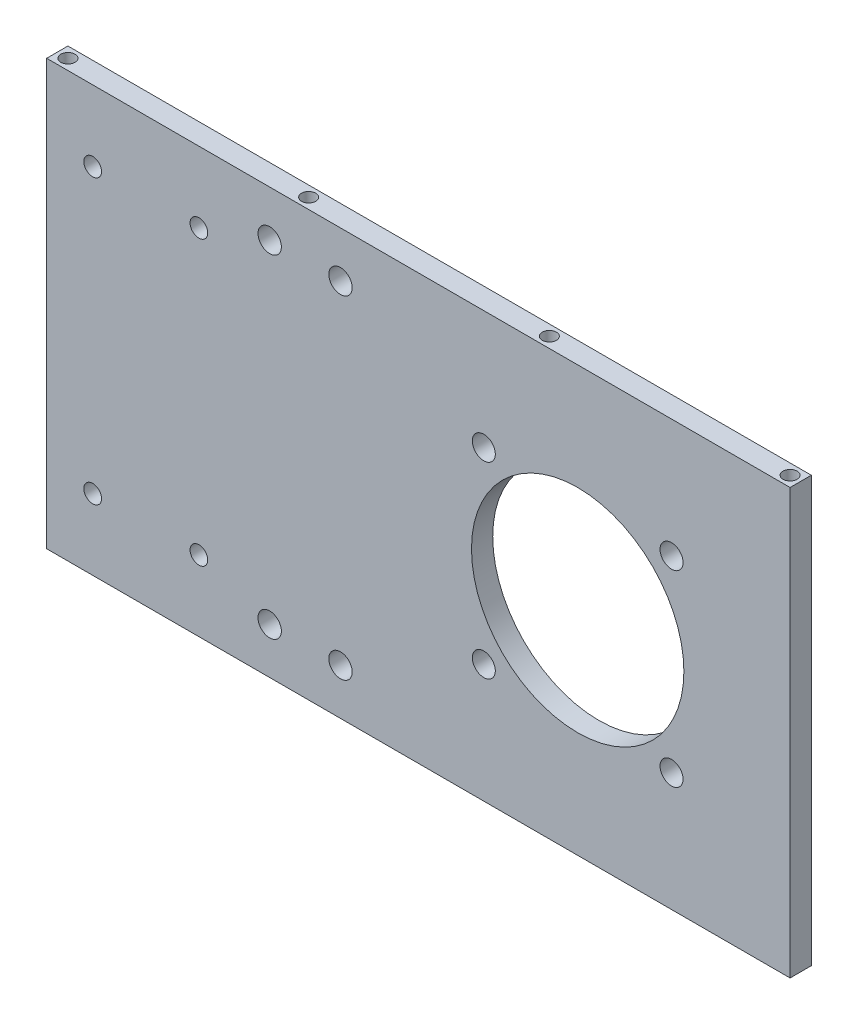
ISO-10303-21;
HEADER;
FILE_DESCRIPTION(('STEP AP214'),'2;1');
FILE_NAME('part.step','',(''),(''),'','','');
FILE_SCHEMA(('AUTOMOTIVE_DESIGN { 1 0 10303 214 1 1 1 1 }'));
ENDSEC;
DATA;
#1=APPLICATION_CONTEXT('core data for automotive mechanical design processes');
#2=APPLICATION_PROTOCOL_DEFINITION('international standard','automotive_design',2000,#1);
#3=PRODUCT_CONTEXT('',#1,'mechanical');
#4=PRODUCT('Part','Part','',(#3));
#5=PRODUCT_RELATED_PRODUCT_CATEGORY('part','',(#4));
#6=PRODUCT_DEFINITION_FORMATION('','',#4);
#7=PRODUCT_DEFINITION_CONTEXT('part definition',#1,'design');
#8=PRODUCT_DEFINITION('design','',#6,#7);
#9=PRODUCT_DEFINITION_SHAPE('','',#8);
#10=(LENGTH_UNIT() NAMED_UNIT(*) SI_UNIT(.MILLI.,.METRE.));
#11=(NAMED_UNIT(*) PLANE_ANGLE_UNIT() SI_UNIT($,.RADIAN.));
#12=(NAMED_UNIT(*) SI_UNIT($,.STERADIAN.) SOLID_ANGLE_UNIT());
#13=UNCERTAINTY_MEASURE_WITH_UNIT(LENGTH_MEASURE(1.E-05),#10,'distance_accuracy_value','');
#14=(GEOMETRIC_REPRESENTATION_CONTEXT(3) GLOBAL_UNCERTAINTY_ASSIGNED_CONTEXT((#13)) GLOBAL_UNIT_ASSIGNED_CONTEXT((#10,
#11,#12)) REPRESENTATION_CONTEXT('',''));
#15=CARTESIAN_POINT('',(0.,0.,0.));
#16=DIRECTION('',(0.,0.,1.));
#17=DIRECTION('',(1.,0.,0.));
#18=AXIS2_PLACEMENT_3D('',#15,#16,#17);
#19=CARTESIAN_POINT('',(60.,60.,6.));
#20=DIRECTION('',(0.,-1.,0.));
#21=DIRECTION('',(1.,0.,0.));
#22=AXIS2_PLACEMENT_3D('',#19,#20,#21);
#23=PLANE('',#22);
#24=CARTESIAN_POINT('',(-79.,60.,3.));
#25=DIRECTION('',(0.,-1.,0.));
#26=DIRECTION('',(1.,0.,0.));
#27=AXIS2_PLACEMENT_3D('',#24,#25,#26);
#28=CIRCLE('',#27,2.);
#29=CARTESIAN_POINT('',(-77.,60.,3.));
#30=VERTEX_POINT('',#29);
#31=EDGE_CURVE('E156',#30,#30,#28,.T.);
#32=ORIENTED_EDGE('',*,*,#31,.T.);
#33=EDGE_LOOP('',(#32));
#34=FACE_BOUND('',#33,.T.);
#35=CARTESIAN_POINT('',(57.,60.,3.));
#36=DIRECTION('',(0.,-1.,0.));
#37=DIRECTION('',(1.,0.,0.));
#38=AXIS2_PLACEMENT_3D('',#35,#36,#37);
#39=CIRCLE('',#38,2.);
#40=CARTESIAN_POINT('',(59.,60.,3.));
#41=VERTEX_POINT('',#40);
#42=EDGE_CURVE('E168',#41,#41,#39,.T.);
#43=ORIENTED_EDGE('',*,*,#42,.T.);
#44=EDGE_LOOP('',(#43));
#45=FACE_BOUND('',#44,.T.);
#46=DIRECTION('',(-1.,0.,0.));
#47=VECTOR('',#46,1.);
#48=CARTESIAN_POINT('',(60.,60.,0.));
#49=LINE('',#48,#47);
#50=CARTESIAN_POINT('',(60.,60.,0.));
#51=VERTEX_POINT('',#50);
#52=CARTESIAN_POINT('',(-150.,60.,0.));
#53=VERTEX_POINT('',#52);
#54=EDGE_CURVE('E70',#51,#53,#49,.T.);
#55=ORIENTED_EDGE('',*,*,#54,.T.);
#56=DIRECTION('',(0.,0.,-1.));
#57=VECTOR('',#56,1.);
#58=CARTESIAN_POINT('',(-150.,60.,6.));
#59=LINE('',#58,#57);
#60=CARTESIAN_POINT('',(-150.,60.,6.));
#61=VERTEX_POINT('',#60);
#62=EDGE_CURVE('E94',#61,#53,#59,.T.);
#63=ORIENTED_EDGE('',*,*,#62,.F.);
#64=DIRECTION('',(-1.,0.,0.));
#65=VECTOR('',#64,1.);
#66=CARTESIAN_POINT('',(60.,60.,6.));
#67=LINE('',#66,#65);
#68=CARTESIAN_POINT('',(60.,60.,6.));
#69=VERTEX_POINT('',#68);
#70=EDGE_CURVE('E87',#69,#61,#67,.T.);
#71=ORIENTED_EDGE('',*,*,#70,.F.);
#72=DIRECTION('',(0.,0.,-1.));
#73=VECTOR('',#72,1.);
#74=CARTESIAN_POINT('',(60.,60.,6.));
#75=LINE('',#74,#73);
#76=EDGE_CURVE('E44',#69,#51,#75,.T.);
#77=ORIENTED_EDGE('',*,*,#76,.T.);
#78=EDGE_LOOP('',(#55,#63,#71,#77));
#79=FACE_BOUND('',#78,.T.);
#80=CARTESIAN_POINT('',(-11.,60.,3.));
#81=DIRECTION('',(0.,-1.,0.));
#82=DIRECTION('',(1.,0.,0.));
#83=AXIS2_PLACEMENT_3D('',#80,#81,#82);
#84=CIRCLE('',#83,2.);
#85=CARTESIAN_POINT('',(-9.,60.,3.));
#86=VERTEX_POINT('',#85);
#87=EDGE_CURVE('E162',#86,#86,#84,.T.);
#88=ORIENTED_EDGE('',*,*,#87,.T.);
#89=EDGE_LOOP('',(#88));
#90=FACE_BOUND('',#89,.T.);
#91=CARTESIAN_POINT('',(-147.,60.,3.));
#92=DIRECTION('',(0.,-1.,0.));
#93=DIRECTION('',(1.,0.,0.));
#94=AXIS2_PLACEMENT_3D('',#91,#92,#93);
#95=CIRCLE('',#94,2.);
#96=CARTESIAN_POINT('',(-145.,60.,3.));
#97=VERTEX_POINT('',#96);
#98=EDGE_CURVE('E131',#97,#97,#95,.T.);
#99=ORIENTED_EDGE('',*,*,#98,.T.);
#100=EDGE_LOOP('',(#99));
#101=FACE_BOUND('',#100,.T.);
#102=ADVANCED_FACE('F34',(#34,#45,#79,#90,#101),#23,.F.);
#103=CARTESIAN_POINT('',(0.,0.,6.));
#104=DIRECTION('',(0.,0.,1.));
#105=DIRECTION('',(1.,0.,0.));
#106=AXIS2_PLACEMENT_3D('',#103,#104,#105);
#107=PLANE('',#106);
#108=CARTESIAN_POINT('',(-87.,-47.,6.));
#109=DIRECTION('',(0.,0.,1.));
#110=DIRECTION('',(-1.,0.,0.));
#111=AXIS2_PLACEMENT_3D('',#108,#109,#110);
#112=CIRCLE('',#111,3.3);
#113=CARTESIAN_POINT('',(-90.3,-47.,6.));
#114=VERTEX_POINT('',#113);
#115=EDGE_CURVE('E148',#114,#114,#112,.T.);
#116=ORIENTED_EDGE('',*,*,#115,.F.);
#117=EDGE_LOOP('',(#116));
#118=FACE_BOUND('',#117,.T.);
#119=CARTESIAN_POINT('',(-67.,-47.,6.));
#120=DIRECTION('',(0.,0.,1.));
#121=DIRECTION('',(1.,0.,0.));
#122=AXIS2_PLACEMENT_3D('',#119,#120,#121);
#123=CIRCLE('',#122,3.3);
#124=CARTESIAN_POINT('',(-63.7,-47.,6.));
#125=VERTEX_POINT('',#124);
#126=EDGE_CURVE('E138',#125,#125,#123,.T.);
#127=ORIENTED_EDGE('',*,*,#126,.F.);
#128=EDGE_LOOP('',(#127));
#129=FACE_BOUND('',#128,.T.);
#130=CARTESIAN_POINT('',(-67.,47.,6.));
#131=DIRECTION('',(0.,0.,1.));
#132=DIRECTION('',(-1.,0.,0.));
#133=AXIS2_PLACEMENT_3D('',#130,#131,#132);
#134=CIRCLE('',#133,3.3);
#135=CARTESIAN_POINT('',(-70.3,47.,6.));
#136=VERTEX_POINT('',#135);
#137=EDGE_CURVE('E135',#136,#136,#134,.T.);
#138=ORIENTED_EDGE('',*,*,#137,.F.);
#139=EDGE_LOOP('',(#138));
#140=FACE_BOUND('',#139,.T.);
#141=CARTESIAN_POINT('',(-87.,47.,6.));
#142=DIRECTION('',(0.,0.,1.));
#143=DIRECTION('',(1.,0.,0.));
#144=AXIS2_PLACEMENT_3D('',#141,#142,#143);
#145=CIRCLE('',#144,3.3);
#146=CARTESIAN_POINT('',(-83.7,47.,6.));
#147=VERTEX_POINT('',#146);
#148=EDGE_CURVE('E132',#147,#147,#145,.T.);
#149=ORIENTED_EDGE('',*,*,#148,.F.);
#150=EDGE_LOOP('',(#149));
#151=FACE_BOUND('',#150,.T.);
#152=CARTESIAN_POINT('',(-137.,-40.,6.));
#153=DIRECTION('',(0.,0.,1.));
#154=DIRECTION('',(1.,0.,0.));
#155=AXIS2_PLACEMENT_3D('',#152,#153,#154);
#156=CIRCLE('',#155,2.5);
#157=CARTESIAN_POINT('',(-134.5,-40.,6.));
#158=VERTEX_POINT('',#157);
#159=EDGE_CURVE('E127',#158,#158,#156,.T.);
#160=ORIENTED_EDGE('',*,*,#159,.F.);
#161=EDGE_LOOP('',(#160));
#162=FACE_BOUND('',#161,.T.);
#163=CARTESIAN_POINT('',(-107.,-40.,6.));
#164=DIRECTION('',(0.,0.,1.));
#165=DIRECTION('',(1.,0.,0.));
#166=AXIS2_PLACEMENT_3D('',#163,#164,#165);
#167=CIRCLE('',#166,2.50000000000001);
#168=CARTESIAN_POINT('',(-104.5,-40.,6.));
#169=VERTEX_POINT('',#168);
#170=EDGE_CURVE('E123',#169,#169,#167,.T.);
#171=ORIENTED_EDGE('',*,*,#170,.F.);
#172=EDGE_LOOP('',(#171));
#173=FACE_BOUND('',#172,.T.);
#174=CARTESIAN_POINT('',(-107.,40.,6.));
#175=DIRECTION('',(0.,0.,1.));
#176=DIRECTION('',(1.,0.,0.));
#177=AXIS2_PLACEMENT_3D('',#174,#175,#176);
#178=CIRCLE('',#177,2.5);
#179=CARTESIAN_POINT('',(-104.5,40.,6.));
#180=VERTEX_POINT('',#179);
#181=EDGE_CURVE('E119',#180,#180,#178,.T.);
#182=ORIENTED_EDGE('',*,*,#181,.F.);
#183=EDGE_LOOP('',(#182));
#184=FACE_BOUND('',#183,.T.);
#185=CARTESIAN_POINT('',(-137.,40.,6.));
#186=DIRECTION('',(0.,0.,1.));
#187=DIRECTION('',(1.,0.,0.));
#188=AXIS2_PLACEMENT_3D('',#185,#186,#187);
#189=CIRCLE('',#188,2.5);
#190=CARTESIAN_POINT('',(-134.5,40.,6.));
#191=VERTEX_POINT('',#190);
#192=EDGE_CURVE('E115',#191,#191,#189,.T.);
#193=ORIENTED_EDGE('',*,*,#192,.F.);
#194=EDGE_LOOP('',(#193));
#195=FACE_BOUND('',#194,.T.);
#196=CARTESIAN_POINT('',(-26.5165042944938,-26.5165042944972,6.));
#197=DIRECTION('',(0.,0.,1.));
#198=DIRECTION('',(1.,0.,0.));
#199=AXIS2_PLACEMENT_3D('',#196,#197,#198);
#200=CIRCLE('',#199,3.25);
#201=CARTESIAN_POINT('',(-23.2665042944938,-26.5165042944972,6.));
#202=VERTEX_POINT('',#201);
#203=EDGE_CURVE('E214',#202,#202,#200,.T.);
#204=ORIENTED_EDGE('',*,*,#203,.F.);
#205=EDGE_LOOP('',(#204));
#206=FACE_BOUND('',#205,.T.);
#207=CARTESIAN_POINT('',(0.,0.,6.));
#208=DIRECTION('',(0.,0.,1.));
#209=DIRECTION('',(1.,0.,0.));
#210=AXIS2_PLACEMENT_3D('',#207,#208,#209);
#211=CIRCLE('',#210,30.);
#212=CARTESIAN_POINT('',(30.,0.,6.));
#213=VERTEX_POINT('',#212);
#214=EDGE_CURVE('E226',#213,#213,#211,.T.);
#215=ORIENTED_EDGE('',*,*,#214,.F.);
#216=EDGE_LOOP('',(#215));
#217=FACE_BOUND('',#216,.T.);
#218=DIRECTION('',(1.,0.,0.));
#219=VECTOR('',#218,1.);
#220=CARTESIAN_POINT('',(60.,-60.,6.));
#221=LINE('',#220,#219);
#222=CARTESIAN_POINT('',(-150.,-60.,6.));
#223=VERTEX_POINT('',#222);
#224=CARTESIAN_POINT('',(60.,-60.,6.));
#225=VERTEX_POINT('',#224);
#226=EDGE_CURVE('E89',#223,#225,#221,.T.);
#227=ORIENTED_EDGE('',*,*,#226,.T.);
#228=DIRECTION('',(0.,1.,0.));
#229=VECTOR('',#228,1.);
#230=CARTESIAN_POINT('',(60.,-60.,6.));
#231=LINE('',#230,#229);
#232=EDGE_CURVE('E83',#225,#69,#231,.T.);
#233=ORIENTED_EDGE('',*,*,#232,.T.);
#234=ORIENTED_EDGE('',*,*,#70,.T.);
#235=DIRECTION('',(0.,-1.,0.));
#236=VECTOR('',#235,1.);
#237=CARTESIAN_POINT('',(-150.,60.,6.));
#238=LINE('',#237,#236);
#239=EDGE_CURVE('E53',#61,#223,#238,.T.);
#240=ORIENTED_EDGE('',*,*,#239,.T.);
#241=EDGE_LOOP('',(#227,#233,#234,#240));
#242=FACE_BOUND('',#241,.T.);
#243=CARTESIAN_POINT('',(26.5165042944955,26.5165042944956,6.));
#244=DIRECTION('',(0.,0.,1.));
#245=DIRECTION('',(1.,0.,0.));
#246=AXIS2_PLACEMENT_3D('',#243,#244,#245);
#247=CIRCLE('',#246,3.25);
#248=CARTESIAN_POINT('',(29.7665042944955,26.5165042944956,6.));
#249=VERTEX_POINT('',#248);
#250=EDGE_CURVE('E105',#249,#249,#247,.T.);
#251=ORIENTED_EDGE('',*,*,#250,.F.);
#252=EDGE_LOOP('',(#251));
#253=FACE_BOUND('',#252,.T.);
#254=CARTESIAN_POINT('',(26.5165042944972,-26.5165042944955,6.));
#255=DIRECTION('',(0.,0.,1.));
#256=DIRECTION('',(1.,0.,0.));
#257=AXIS2_PLACEMENT_3D('',#254,#255,#256);
#258=CIRCLE('',#257,3.25);
#259=CARTESIAN_POINT('',(29.7665042944972,-26.5165042944955,6.));
#260=VERTEX_POINT('',#259);
#261=EDGE_CURVE('E220',#260,#260,#258,.T.);
#262=ORIENTED_EDGE('',*,*,#261,.F.);
#263=EDGE_LOOP('',(#262));
#264=FACE_BOUND('',#263,.T.);
#265=CARTESIAN_POINT('',(-26.5165042944956,26.5165042944938,6.));
#266=DIRECTION('',(0.,0.,1.));
#267=DIRECTION('',(1.,0.,0.));
#268=AXIS2_PLACEMENT_3D('',#265,#266,#267);
#269=CIRCLE('',#268,3.25);
#270=CARTESIAN_POINT('',(-23.2665042944956,26.5165042944938,6.));
#271=VERTEX_POINT('',#270);
#272=EDGE_CURVE('E208',#271,#271,#269,.T.);
#273=ORIENTED_EDGE('',*,*,#272,.F.);
#274=EDGE_LOOP('',(#273));
#275=FACE_BOUND('',#274,.T.);
#276=ADVANCED_FACE('F84',(#118,#129,#140,#151,#162,#173,#184,#195,#206,#217,#242,#253,#264,
#275),#107,.T.);
#277=CARTESIAN_POINT('',(0.,0.,0.));
#278=DIRECTION('',(0.,0.,1.));
#279=DIRECTION('',(1.,0.,0.));
#280=AXIS2_PLACEMENT_3D('',#277,#278,#279);
#281=PLANE('',#280);
#282=CARTESIAN_POINT('',(-87.,-47.,0.));
#283=DIRECTION('',(0.,0.,1.));
#284=DIRECTION('',(1.,0.,0.));
#285=AXIS2_PLACEMENT_3D('',#282,#283,#284);
#286=CIRCLE('',#285,3.3);
#287=CARTESIAN_POINT('',(-83.7,-47.,0.));
#288=VERTEX_POINT('',#287);
#289=EDGE_CURVE('E38',#288,#288,#286,.T.);
#290=ORIENTED_EDGE('',*,*,#289,.T.);
#291=EDGE_LOOP('',(#290));
#292=FACE_BOUND('',#291,.T.);
#293=CARTESIAN_POINT('',(-67.,-47.,0.));
#294=DIRECTION('',(0.,0.,1.));
#295=DIRECTION('',(1.,0.,0.));
#296=AXIS2_PLACEMENT_3D('',#293,#294,#295);
#297=CIRCLE('',#296,3.3);
#298=CARTESIAN_POINT('',(-63.7,-47.,0.));
#299=VERTEX_POINT('',#298);
#300=EDGE_CURVE('E136',#299,#299,#297,.T.);
#301=ORIENTED_EDGE('',*,*,#300,.T.);
#302=EDGE_LOOP('',(#301));
#303=FACE_BOUND('',#302,.T.);
#304=CARTESIAN_POINT('',(-67.,47.,0.));
#305=DIRECTION('',(0.,0.,1.));
#306=DIRECTION('',(1.,0.,0.));
#307=AXIS2_PLACEMENT_3D('',#304,#305,#306);
#308=CIRCLE('',#307,3.3);
#309=CARTESIAN_POINT('',(-63.7,47.,0.));
#310=VERTEX_POINT('',#309);
#311=EDGE_CURVE('E133',#310,#310,#308,.T.);
#312=ORIENTED_EDGE('',*,*,#311,.T.);
#313=EDGE_LOOP('',(#312));
#314=FACE_BOUND('',#313,.T.);
#315=CARTESIAN_POINT('',(-87.,47.,0.));
#316=DIRECTION('',(0.,0.,1.));
#317=DIRECTION('',(1.,0.,0.));
#318=AXIS2_PLACEMENT_3D('',#315,#316,#317);
#319=CIRCLE('',#318,3.3);
#320=CARTESIAN_POINT('',(-83.7,47.,0.));
#321=VERTEX_POINT('',#320);
#322=EDGE_CURVE('E128',#321,#321,#319,.T.);
#323=ORIENTED_EDGE('',*,*,#322,.T.);
#324=EDGE_LOOP('',(#323));
#325=FACE_BOUND('',#324,.T.);
#326=CARTESIAN_POINT('',(-137.,-40.,0.));
#327=DIRECTION('',(0.,0.,1.));
#328=DIRECTION('',(1.,0.,0.));
#329=AXIS2_PLACEMENT_3D('',#326,#327,#328);
#330=CIRCLE('',#329,2.5);
#331=CARTESIAN_POINT('',(-134.5,-40.,0.));
#332=VERTEX_POINT('',#331);
#333=EDGE_CURVE('E124',#332,#332,#330,.T.);
#334=ORIENTED_EDGE('',*,*,#333,.T.);
#335=EDGE_LOOP('',(#334));
#336=FACE_BOUND('',#335,.T.);
#337=CARTESIAN_POINT('',(-107.,-40.,0.));
#338=DIRECTION('',(0.,0.,1.));
#339=DIRECTION('',(1.,0.,0.));
#340=AXIS2_PLACEMENT_3D('',#337,#338,#339);
#341=CIRCLE('',#340,2.50000000000001);
#342=CARTESIAN_POINT('',(-104.5,-40.,0.));
#343=VERTEX_POINT('',#342);
#344=EDGE_CURVE('E120',#343,#343,#341,.T.);
#345=ORIENTED_EDGE('',*,*,#344,.T.);
#346=EDGE_LOOP('',(#345));
#347=FACE_BOUND('',#346,.T.);
#348=CARTESIAN_POINT('',(-107.,40.,0.));
#349=DIRECTION('',(0.,0.,1.));
#350=DIRECTION('',(1.,0.,0.));
#351=AXIS2_PLACEMENT_3D('',#348,#349,#350);
#352=CIRCLE('',#351,2.5);
#353=CARTESIAN_POINT('',(-104.5,40.,0.));
#354=VERTEX_POINT('',#353);
#355=EDGE_CURVE('E116',#354,#354,#352,.T.);
#356=ORIENTED_EDGE('',*,*,#355,.T.);
#357=EDGE_LOOP('',(#356));
#358=FACE_BOUND('',#357,.T.);
#359=CARTESIAN_POINT('',(-137.,40.,0.));
#360=DIRECTION('',(0.,0.,1.));
#361=DIRECTION('',(1.,0.,0.));
#362=AXIS2_PLACEMENT_3D('',#359,#360,#361);
#363=CIRCLE('',#362,2.5);
#364=CARTESIAN_POINT('',(-134.5,40.,0.));
#365=VERTEX_POINT('',#364);
#366=EDGE_CURVE('E111',#365,#365,#363,.T.);
#367=ORIENTED_EDGE('',*,*,#366,.T.);
#368=EDGE_LOOP('',(#367));
#369=FACE_BOUND('',#368,.T.);
#370=CARTESIAN_POINT('',(-26.5165042944938,-26.5165042944972,0.));
#371=DIRECTION('',(0.,0.,1.));
#372=DIRECTION('',(1.,0.,0.));
#373=AXIS2_PLACEMENT_3D('',#370,#371,#372);
#374=CIRCLE('',#373,3.25);
#375=CARTESIAN_POINT('',(-23.2665042944938,-26.5165042944972,0.));
#376=VERTEX_POINT('',#375);
#377=EDGE_CURVE('E211',#376,#376,#374,.T.);
#378=ORIENTED_EDGE('',*,*,#377,.T.);
#379=EDGE_LOOP('',(#378));
#380=FACE_BOUND('',#379,.T.);
#381=CARTESIAN_POINT('',(0.,0.,0.));
#382=DIRECTION('',(0.,0.,1.));
#383=DIRECTION('',(1.,0.,0.));
#384=AXIS2_PLACEMENT_3D('',#381,#382,#383);
#385=CIRCLE('',#384,30.);
#386=CARTESIAN_POINT('',(30.,0.,0.));
#387=VERTEX_POINT('',#386);
#388=EDGE_CURVE('E223',#387,#387,#385,.T.);
#389=ORIENTED_EDGE('',*,*,#388,.T.);
#390=EDGE_LOOP('',(#389));
#391=FACE_BOUND('',#390,.T.);
#392=DIRECTION('',(1.,0.,0.));
#393=VECTOR('',#392,1.);
#394=CARTESIAN_POINT('',(60.,-60.,0.));
#395=LINE('',#394,#393);
#396=CARTESIAN_POINT('',(-150.,-60.,0.));
#397=VERTEX_POINT('',#396);
#398=CARTESIAN_POINT('',(60.,-60.,0.));
#399=VERTEX_POINT('',#398);
#400=EDGE_CURVE('E102',#397,#399,#395,.T.);
#401=ORIENTED_EDGE('',*,*,#400,.F.);
#402=DIRECTION('',(0.,-1.,0.));
#403=VECTOR('',#402,1.);
#404=CARTESIAN_POINT('',(-150.,60.,0.));
#405=LINE('',#404,#403);
#406=EDGE_CURVE('E76',#53,#397,#405,.T.);
#407=ORIENTED_EDGE('',*,*,#406,.F.);
#408=ORIENTED_EDGE('',*,*,#54,.F.);
#409=DIRECTION('',(0.,1.,0.));
#410=VECTOR('',#409,1.);
#411=CARTESIAN_POINT('',(60.,-60.,0.));
#412=LINE('',#411,#410);
#413=EDGE_CURVE('E93',#399,#51,#412,.T.);
#414=ORIENTED_EDGE('',*,*,#413,.F.);
#415=EDGE_LOOP('',(#401,#407,#408,#414));
#416=FACE_BOUND('',#415,.T.);
#417=CARTESIAN_POINT('',(26.5165042944955,26.5165042944956,0.));
#418=DIRECTION('',(0.,0.,1.));
#419=DIRECTION('',(1.,0.,0.));
#420=AXIS2_PLACEMENT_3D('',#417,#418,#419);
#421=CIRCLE('',#420,3.25);
#422=CARTESIAN_POINT('',(29.7665042944955,26.5165042944956,0.));
#423=VERTEX_POINT('',#422);
#424=EDGE_CURVE('E229',#423,#423,#421,.T.);
#425=ORIENTED_EDGE('',*,*,#424,.T.);
#426=EDGE_LOOP('',(#425));
#427=FACE_BOUND('',#426,.T.);
#428=CARTESIAN_POINT('',(26.5165042944972,-26.5165042944955,0.));
#429=DIRECTION('',(0.,0.,1.));
#430=DIRECTION('',(1.,0.,0.));
#431=AXIS2_PLACEMENT_3D('',#428,#429,#430);
#432=CIRCLE('',#431,3.25);
#433=CARTESIAN_POINT('',(29.7665042944972,-26.5165042944955,0.));
#434=VERTEX_POINT('',#433);
#435=EDGE_CURVE('E217',#434,#434,#432,.T.);
#436=ORIENTED_EDGE('',*,*,#435,.T.);
#437=EDGE_LOOP('',(#436));
#438=FACE_BOUND('',#437,.T.);
#439=CARTESIAN_POINT('',(-26.5165042944956,26.5165042944938,0.));
#440=DIRECTION('',(0.,0.,1.));
#441=DIRECTION('',(1.,0.,0.));
#442=AXIS2_PLACEMENT_3D('',#439,#440,#441);
#443=CIRCLE('',#442,3.25);
#444=CARTESIAN_POINT('',(-23.2665042944956,26.5165042944938,0.));
#445=VERTEX_POINT('',#444);
#446=EDGE_CURVE('E114',#445,#445,#443,.T.);
#447=ORIENTED_EDGE('',*,*,#446,.T.);
#448=EDGE_LOOP('',(#447));
#449=FACE_BOUND('',#448,.T.);
#450=ADVANCED_FACE('F237',(#292,#303,#314,#325,#336,#347,#358,#369,#380,#391,#416,#427,#438,
#449),#281,.F.);
#451=CARTESIAN_POINT('',(60.,-60.,6.));
#452=DIRECTION('',(0.,1.,0.));
#453=DIRECTION('',(-1.,0.,0.));
#454=AXIS2_PLACEMENT_3D('',#451,#452,#453);
#455=PLANE('',#454);
#456=CARTESIAN_POINT('',(-147.,-60.,3.));
#457=DIRECTION('',(0.,-1.,0.));
#458=DIRECTION('',(1.,0.,0.));
#459=AXIS2_PLACEMENT_3D('',#456,#457,#458);
#460=CIRCLE('',#459,2.);
#461=CARTESIAN_POINT('',(-145.,-60.,3.));
#462=VERTEX_POINT('',#461);
#463=EDGE_CURVE('E174',#462,#462,#460,.T.);
#464=ORIENTED_EDGE('',*,*,#463,.F.);
#465=EDGE_LOOP('',(#464));
#466=FACE_BOUND('',#465,.T.);
#467=CARTESIAN_POINT('',(-79.,-60.,3.));
#468=DIRECTION('',(0.,-1.,0.));
#469=DIRECTION('',(1.,0.,0.));
#470=AXIS2_PLACEMENT_3D('',#467,#468,#469);
#471=CIRCLE('',#470,2.);
#472=CARTESIAN_POINT('',(-77.,-60.,3.));
#473=VERTEX_POINT('',#472);
#474=EDGE_CURVE('E180',#473,#473,#471,.T.);
#475=ORIENTED_EDGE('',*,*,#474,.F.);
#476=EDGE_LOOP('',(#475));
#477=FACE_BOUND('',#476,.T.);
#478=CARTESIAN_POINT('',(-11.,-60.,3.));
#479=DIRECTION('',(0.,-1.,0.));
#480=DIRECTION('',(1.,0.,0.));
#481=AXIS2_PLACEMENT_3D('',#478,#479,#480);
#482=CIRCLE('',#481,2.);
#483=CARTESIAN_POINT('',(-9.,-60.,3.));
#484=VERTEX_POINT('',#483);
#485=EDGE_CURVE('E186',#484,#484,#482,.T.);
#486=ORIENTED_EDGE('',*,*,#485,.F.);
#487=EDGE_LOOP('',(#486));
#488=FACE_BOUND('',#487,.T.);
#489=CARTESIAN_POINT('',(57.,-60.,3.));
#490=DIRECTION('',(0.,-1.,0.));
#491=DIRECTION('',(1.,0.,0.));
#492=AXIS2_PLACEMENT_3D('',#489,#490,#491);
#493=CIRCLE('',#492,2.);
#494=CARTESIAN_POINT('',(59.,-60.,3.));
#495=VERTEX_POINT('',#494);
#496=EDGE_CURVE('E192',#495,#495,#493,.T.);
#497=ORIENTED_EDGE('',*,*,#496,.F.);
#498=EDGE_LOOP('',(#497));
#499=FACE_BOUND('',#498,.T.);
#500=ORIENTED_EDGE('',*,*,#400,.T.);
#501=DIRECTION('',(0.,0.,-1.));
#502=VECTOR('',#501,1.);
#503=CARTESIAN_POINT('',(60.,-60.,6.));
#504=LINE('',#503,#502);
#505=EDGE_CURVE('E11',#225,#399,#504,.T.);
#506=ORIENTED_EDGE('',*,*,#505,.F.);
#507=ORIENTED_EDGE('',*,*,#226,.F.);
#508=DIRECTION('',(0.,0.,-1.));
#509=VECTOR('',#508,1.);
#510=CARTESIAN_POINT('',(-150.,-60.,6.));
#511=LINE('',#510,#509);
#512=EDGE_CURVE('E98',#223,#397,#511,.T.);
#513=ORIENTED_EDGE('',*,*,#512,.T.);
#514=EDGE_LOOP('',(#500,#506,#507,#513));
#515=FACE_BOUND('',#514,.T.);
#516=ADVANCED_FACE('F36',(#466,#477,#488,#499,#515),#455,.F.);
#517=CARTESIAN_POINT('',(60.,-60.,6.));
#518=DIRECTION('',(-1.,0.,0.));
#519=DIRECTION('',(0.,0.,1.));
#520=AXIS2_PLACEMENT_3D('',#517,#518,#519);
#521=PLANE('',#520);
#522=ORIENTED_EDGE('',*,*,#413,.T.);
#523=ORIENTED_EDGE('',*,*,#76,.F.);
#524=ORIENTED_EDGE('',*,*,#232,.F.);
#525=ORIENTED_EDGE('',*,*,#505,.T.);
#526=EDGE_LOOP('',(#522,#523,#524,#525));
#527=FACE_BOUND('',#526,.T.);
#528=ADVANCED_FACE('F92',(#527),#521,.F.);
#529=CARTESIAN_POINT('',(-150.,60.,6.));
#530=DIRECTION('',(1.,0.,0.));
#531=DIRECTION('',(0.,0.,-1.));
#532=AXIS2_PLACEMENT_3D('',#529,#530,#531);
#533=PLANE('',#532);
#534=ORIENTED_EDGE('',*,*,#406,.T.);
#535=ORIENTED_EDGE('',*,*,#512,.F.);
#536=ORIENTED_EDGE('',*,*,#239,.F.);
#537=ORIENTED_EDGE('',*,*,#62,.T.);
#538=EDGE_LOOP('',(#534,#535,#536,#537));
#539=FACE_BOUND('',#538,.T.);
#540=ADVANCED_FACE('F243',(#539),#533,.F.);
#541=CARTESIAN_POINT('',(26.5165042944955,26.5165042944956,6.));
#542=DIRECTION('',(0.,0.,-1.));
#543=DIRECTION('',(-1.,0.,0.));
#544=AXIS2_PLACEMENT_3D('',#541,#542,#543);
#545=CYLINDRICAL_SURFACE('',#544,3.25);
#546=ORIENTED_EDGE('',*,*,#250,.T.);
#547=EDGE_LOOP('',(#546));
#548=FACE_BOUND('',#547,.T.);
#549=ORIENTED_EDGE('',*,*,#424,.F.);
#550=EDGE_LOOP('',(#549));
#551=FACE_BOUND('',#550,.T.);
#552=ADVANCED_FACE('F240',(#548,#551),#545,.F.);
#553=CARTESIAN_POINT('',(0.,0.,6.));
#554=DIRECTION('',(0.,0.,-1.));
#555=DIRECTION('',(-1.,0.,0.));
#556=AXIS2_PLACEMENT_3D('',#553,#554,#555);
#557=CYLINDRICAL_SURFACE('',#556,30.);
#558=ORIENTED_EDGE('',*,*,#214,.T.);
#559=EDGE_LOOP('',(#558));
#560=FACE_BOUND('',#559,.T.);
#561=ORIENTED_EDGE('',*,*,#388,.F.);
#562=EDGE_LOOP('',(#561));
#563=FACE_BOUND('',#562,.T.);
#564=ADVANCED_FACE('F242',(#560,#563),#557,.F.);
#565=CARTESIAN_POINT('',(26.5165042944972,-26.5165042944955,6.));
#566=DIRECTION('',(0.,0.,-1.));
#567=DIRECTION('',(-1.,0.,0.));
#568=AXIS2_PLACEMENT_3D('',#565,#566,#567);
#569=CYLINDRICAL_SURFACE('',#568,3.25);
#570=ORIENTED_EDGE('',*,*,#261,.T.);
#571=EDGE_LOOP('',(#570));
#572=FACE_BOUND('',#571,.T.);
#573=ORIENTED_EDGE('',*,*,#435,.F.);
#574=EDGE_LOOP('',(#573));
#575=FACE_BOUND('',#574,.T.);
#576=ADVANCED_FACE('F250',(#572,#575),#569,.F.);
#577=CARTESIAN_POINT('',(-26.5165042944938,-26.5165042944972,6.));
#578=DIRECTION('',(0.,0.,-1.));
#579=DIRECTION('',(-1.,0.,0.));
#580=AXIS2_PLACEMENT_3D('',#577,#578,#579);
#581=CYLINDRICAL_SURFACE('',#580,3.25);
#582=ORIENTED_EDGE('',*,*,#203,.T.);
#583=EDGE_LOOP('',(#582));
#584=FACE_BOUND('',#583,.T.);
#585=ORIENTED_EDGE('',*,*,#377,.F.);
#586=EDGE_LOOP('',(#585));
#587=FACE_BOUND('',#586,.T.);
#588=ADVANCED_FACE('F317',(#584,#587),#581,.F.);
#589=CARTESIAN_POINT('',(-26.5165042944956,26.5165042944938,6.));
#590=DIRECTION('',(0.,0.,-1.));
#591=DIRECTION('',(-1.,0.,0.));
#592=AXIS2_PLACEMENT_3D('',#589,#590,#591);
#593=CYLINDRICAL_SURFACE('',#592,3.25);
#594=ORIENTED_EDGE('',*,*,#272,.T.);
#595=EDGE_LOOP('',(#594));
#596=FACE_BOUND('',#595,.T.);
#597=ORIENTED_EDGE('',*,*,#446,.F.);
#598=EDGE_LOOP('',(#597));
#599=FACE_BOUND('',#598,.T.);
#600=ADVANCED_FACE('F313',(#596,#599),#593,.F.);
#601=CARTESIAN_POINT('',(-137.,40.,-4.));
#602=DIRECTION('',(0.,0.,1.));
#603=DIRECTION('',(1.,0.,0.));
#604=AXIS2_PLACEMENT_3D('',#601,#602,#603);
#605=CYLINDRICAL_SURFACE('',#604,2.5);
#606=ORIENTED_EDGE('',*,*,#192,.T.);
#607=EDGE_LOOP('',(#606));
#608=FACE_BOUND('',#607,.T.);
#609=ORIENTED_EDGE('',*,*,#366,.F.);
#610=EDGE_LOOP('',(#609));
#611=FACE_BOUND('',#610,.T.);
#612=ADVANCED_FACE('F309',(#608,#611),#605,.F.);
#613=CARTESIAN_POINT('',(-107.,40.,-4.));
#614=DIRECTION('',(0.,0.,1.));
#615=DIRECTION('',(1.,0.,0.));
#616=AXIS2_PLACEMENT_3D('',#613,#614,#615);
#617=CYLINDRICAL_SURFACE('',#616,2.5);
#618=ORIENTED_EDGE('',*,*,#181,.T.);
#619=EDGE_LOOP('',(#618));
#620=FACE_BOUND('',#619,.T.);
#621=ORIENTED_EDGE('',*,*,#355,.F.);
#622=EDGE_LOOP('',(#621));
#623=FACE_BOUND('',#622,.T.);
#624=ADVANCED_FACE('F305',(#620,#623),#617,.F.);
#625=CARTESIAN_POINT('',(-107.,-40.,-4.));
#626=DIRECTION('',(0.,0.,1.));
#627=DIRECTION('',(1.,0.,0.));
#628=AXIS2_PLACEMENT_3D('',#625,#626,#627);
#629=CYLINDRICAL_SURFACE('',#628,2.50000000000001);
#630=ORIENTED_EDGE('',*,*,#170,.T.);
#631=EDGE_LOOP('',(#630));
#632=FACE_BOUND('',#631,.T.);
#633=ORIENTED_EDGE('',*,*,#344,.F.);
#634=EDGE_LOOP('',(#633));
#635=FACE_BOUND('',#634,.T.);
#636=ADVANCED_FACE('F297',(#632,#635),#629,.F.);
#637=CARTESIAN_POINT('',(-137.,-40.,-4.));
#638=DIRECTION('',(0.,0.,1.));
#639=DIRECTION('',(1.,0.,0.));
#640=AXIS2_PLACEMENT_3D('',#637,#638,#639);
#641=CYLINDRICAL_SURFACE('',#640,2.5);
#642=ORIENTED_EDGE('',*,*,#159,.T.);
#643=EDGE_LOOP('',(#642));
#644=FACE_BOUND('',#643,.T.);
#645=ORIENTED_EDGE('',*,*,#333,.F.);
#646=EDGE_LOOP('',(#645));
#647=FACE_BOUND('',#646,.T.);
#648=ADVANCED_FACE('F287',(#644,#647),#641,.F.);
#649=CARTESIAN_POINT('',(57.,-40.,3.));
#650=DIRECTION('',(0.,-1.,0.));
#651=DIRECTION('',(1.,0.,0.));
#652=AXIS2_PLACEMENT_3D('',#649,#650,#651);
#653=CYLINDRICAL_SURFACE('',#652,2.);
#654=CARTESIAN_POINT('',(57.,-40.,3.));
#655=DIRECTION('',(0.,-1.,0.));
#656=DIRECTION('',(1.,0.,0.));
#657=AXIS2_PLACEMENT_3D('',#654,#655,#656);
#658=CIRCLE('',#657,2.);
#659=CARTESIAN_POINT('',(59.,-40.,3.));
#660=VERTEX_POINT('',#659);
#661=EDGE_CURVE('E195',#660,#660,#658,.T.);
#662=ORIENTED_EDGE('',*,*,#661,.F.);
#663=EDGE_LOOP('',(#662));
#664=FACE_BOUND('',#663,.T.);
#665=ORIENTED_EDGE('',*,*,#496,.T.);
#666=EDGE_LOOP('',(#665));
#667=FACE_BOUND('',#666,.T.);
#668=ADVANCED_FACE('F284',(#664,#667),#653,.F.);
#669=CARTESIAN_POINT('',(57.,-40.,3.));
#670=DIRECTION('',(0.,-1.,0.));
#671=DIRECTION('',(1.,0.,0.));
#672=AXIS2_PLACEMENT_3D('',#669,#670,#671);
#673=PLANE('',#672);
#674=ORIENTED_EDGE('',*,*,#661,.T.);
#675=EDGE_LOOP('',(#674));
#676=FACE_BOUND('',#675,.T.);
#677=ADVANCED_FACE('F286',(#676),#673,.T.);
#678=CARTESIAN_POINT('',(-11.,-40.,3.));
#679=DIRECTION('',(0.,-1.,0.));
#680=DIRECTION('',(1.,0.,0.));
#681=AXIS2_PLACEMENT_3D('',#678,#679,#680);
#682=CYLINDRICAL_SURFACE('',#681,2.);
#683=CARTESIAN_POINT('',(-11.,-40.,3.));
#684=DIRECTION('',(0.,-1.,0.));
#685=DIRECTION('',(1.,0.,0.));
#686=AXIS2_PLACEMENT_3D('',#683,#684,#685);
#687=CIRCLE('',#686,2.);
#688=CARTESIAN_POINT('',(-9.,-40.,3.));
#689=VERTEX_POINT('',#688);
#690=EDGE_CURVE('E189',#689,#689,#687,.T.);
#691=ORIENTED_EDGE('',*,*,#690,.F.);
#692=EDGE_LOOP('',(#691));
#693=FACE_BOUND('',#692,.T.);
#694=ORIENTED_EDGE('',*,*,#485,.T.);
#695=EDGE_LOOP('',(#694));
#696=FACE_BOUND('',#695,.T.);
#697=ADVANCED_FACE('F294',(#693,#696),#682,.F.);
#698=CARTESIAN_POINT('',(-11.,-40.,3.));
#699=DIRECTION('',(0.,-1.,0.));
#700=DIRECTION('',(1.,0.,0.));
#701=AXIS2_PLACEMENT_3D('',#698,#699,#700);
#702=PLANE('',#701);
#703=ORIENTED_EDGE('',*,*,#690,.T.);
#704=EDGE_LOOP('',(#703));
#705=FACE_BOUND('',#704,.T.);
#706=ADVANCED_FACE('F386',(#705),#702,.T.);
#707=CARTESIAN_POINT('',(-79.,-40.,3.));
#708=DIRECTION('',(0.,-1.,0.));
#709=DIRECTION('',(1.,0.,0.));
#710=AXIS2_PLACEMENT_3D('',#707,#708,#709);
#711=CYLINDRICAL_SURFACE('',#710,2.);
#712=CARTESIAN_POINT('',(-79.,-40.,3.));
#713=DIRECTION('',(0.,-1.,0.));
#714=DIRECTION('',(1.,0.,0.));
#715=AXIS2_PLACEMENT_3D('',#712,#713,#714);
#716=CIRCLE('',#715,2.);
#717=CARTESIAN_POINT('',(-77.,-40.,3.));
#718=VERTEX_POINT('',#717);
#719=EDGE_CURVE('E183',#718,#718,#716,.T.);
#720=ORIENTED_EDGE('',*,*,#719,.F.);
#721=EDGE_LOOP('',(#720));
#722=FACE_BOUND('',#721,.T.);
#723=ORIENTED_EDGE('',*,*,#474,.T.);
#724=EDGE_LOOP('',(#723));
#725=FACE_BOUND('',#724,.T.);
#726=ADVANCED_FACE('F395',(#722,#725),#711,.F.);
#727=CARTESIAN_POINT('',(-79.,-40.,3.));
#728=DIRECTION('',(0.,-1.,0.));
#729=DIRECTION('',(1.,0.,0.));
#730=AXIS2_PLACEMENT_3D('',#727,#728,#729);
#731=PLANE('',#730);
#732=ORIENTED_EDGE('',*,*,#719,.T.);
#733=EDGE_LOOP('',(#732));
#734=FACE_BOUND('',#733,.T.);
#735=ADVANCED_FACE('F405',(#734),#731,.T.);
#736=CARTESIAN_POINT('',(-147.,-40.,3.));
#737=DIRECTION('',(0.,-1.,0.));
#738=DIRECTION('',(1.,0.,0.));
#739=AXIS2_PLACEMENT_3D('',#736,#737,#738);
#740=CYLINDRICAL_SURFACE('',#739,2.);
#741=CARTESIAN_POINT('',(-147.,-40.,3.));
#742=DIRECTION('',(0.,-1.,0.));
#743=DIRECTION('',(1.,0.,0.));
#744=AXIS2_PLACEMENT_3D('',#741,#742,#743);
#745=CIRCLE('',#744,2.);
#746=CARTESIAN_POINT('',(-145.,-40.,3.));
#747=VERTEX_POINT('',#746);
#748=EDGE_CURVE('E177',#747,#747,#745,.T.);
#749=ORIENTED_EDGE('',*,*,#748,.F.);
#750=EDGE_LOOP('',(#749));
#751=FACE_BOUND('',#750,.T.);
#752=ORIENTED_EDGE('',*,*,#463,.T.);
#753=EDGE_LOOP('',(#752));
#754=FACE_BOUND('',#753,.T.);
#755=ADVANCED_FACE('F415',(#751,#754),#740,.F.);
#756=CARTESIAN_POINT('',(-147.,-40.,3.));
#757=DIRECTION('',(0.,-1.,0.));
#758=DIRECTION('',(1.,0.,0.));
#759=AXIS2_PLACEMENT_3D('',#756,#757,#758);
#760=PLANE('',#759);
#761=ORIENTED_EDGE('',*,*,#748,.T.);
#762=EDGE_LOOP('',(#761));
#763=FACE_BOUND('',#762,.T.);
#764=ADVANCED_FACE('F425',(#763),#760,.T.);
#765=CARTESIAN_POINT('',(57.,40.,3.));
#766=DIRECTION('',(0.,1.,0.));
#767=DIRECTION('',(-1.,0.,0.));
#768=AXIS2_PLACEMENT_3D('',#765,#766,#767);
#769=CYLINDRICAL_SURFACE('',#768,2.);
#770=CARTESIAN_POINT('',(57.,40.,3.));
#771=DIRECTION('',(0.,-1.,0.));
#772=DIRECTION('',(1.,0.,0.));
#773=AXIS2_PLACEMENT_3D('',#770,#771,#772);
#774=CIRCLE('',#773,2.);
#775=CARTESIAN_POINT('',(59.,40.,3.));
#776=VERTEX_POINT('',#775);
#777=EDGE_CURVE('E171',#776,#776,#774,.T.);
#778=ORIENTED_EDGE('',*,*,#777,.T.);
#779=EDGE_LOOP('',(#778));
#780=FACE_BOUND('',#779,.T.);
#781=ORIENTED_EDGE('',*,*,#42,.F.);
#782=EDGE_LOOP('',(#781));
#783=FACE_BOUND('',#782,.T.);
#784=ADVANCED_FACE('F434',(#780,#783),#769,.F.);
#785=CARTESIAN_POINT('',(57.,40.,3.));
#786=DIRECTION('',(0.,1.,0.));
#787=DIRECTION('',(1.,0.,0.));
#788=AXIS2_PLACEMENT_3D('',#785,#786,#787);
#789=PLANE('',#788);
#790=ORIENTED_EDGE('',*,*,#777,.F.);
#791=EDGE_LOOP('',(#790));
#792=FACE_BOUND('',#791,.T.);
#793=ADVANCED_FACE('F449',(#792),#789,.T.);
#794=CARTESIAN_POINT('',(-11.,40.,3.));
#795=DIRECTION('',(0.,1.,0.));
#796=DIRECTION('',(-1.,0.,0.));
#797=AXIS2_PLACEMENT_3D('',#794,#795,#796);
#798=CYLINDRICAL_SURFACE('',#797,2.);
#799=CARTESIAN_POINT('',(-11.,40.,3.));
#800=DIRECTION('',(0.,-1.,0.));
#801=DIRECTION('',(1.,0.,0.));
#802=AXIS2_PLACEMENT_3D('',#799,#800,#801);
#803=CIRCLE('',#802,2.);
#804=CARTESIAN_POINT('',(-9.,40.,3.));
#805=VERTEX_POINT('',#804);
#806=EDGE_CURVE('E165',#805,#805,#803,.T.);
#807=ORIENTED_EDGE('',*,*,#806,.T.);
#808=EDGE_LOOP('',(#807));
#809=FACE_BOUND('',#808,.T.);
#810=ORIENTED_EDGE('',*,*,#87,.F.);
#811=EDGE_LOOP('',(#810));
#812=FACE_BOUND('',#811,.T.);
#813=ADVANCED_FACE('F459',(#809,#812),#798,.F.);
#814=CARTESIAN_POINT('',(-11.,40.,3.));
#815=DIRECTION('',(0.,1.,0.));
#816=DIRECTION('',(1.,0.,0.));
#817=AXIS2_PLACEMENT_3D('',#814,#815,#816);
#818=PLANE('',#817);
#819=ORIENTED_EDGE('',*,*,#806,.F.);
#820=EDGE_LOOP('',(#819));
#821=FACE_BOUND('',#820,.T.);
#822=ADVANCED_FACE('F469',(#821),#818,.T.);
#823=CARTESIAN_POINT('',(-79.,40.,3.));
#824=DIRECTION('',(0.,1.,0.));
#825=DIRECTION('',(-1.,0.,0.));
#826=AXIS2_PLACEMENT_3D('',#823,#824,#825);
#827=CYLINDRICAL_SURFACE('',#826,2.);
#828=CARTESIAN_POINT('',(-79.,40.,3.));
#829=DIRECTION('',(0.,-1.,0.));
#830=DIRECTION('',(1.,0.,0.));
#831=AXIS2_PLACEMENT_3D('',#828,#829,#830);
#832=CIRCLE('',#831,2.);
#833=CARTESIAN_POINT('',(-77.,40.,3.));
#834=VERTEX_POINT('',#833);
#835=EDGE_CURVE('E159',#834,#834,#832,.T.);
#836=ORIENTED_EDGE('',*,*,#835,.T.);
#837=EDGE_LOOP('',(#836));
#838=FACE_BOUND('',#837,.T.);
#839=ORIENTED_EDGE('',*,*,#31,.F.);
#840=EDGE_LOOP('',(#839));
#841=FACE_BOUND('',#840,.T.);
#842=ADVANCED_FACE('F479',(#838,#841),#827,.F.);
#843=CARTESIAN_POINT('',(-79.,40.,3.));
#844=DIRECTION('',(0.,1.,0.));
#845=DIRECTION('',(1.,0.,0.));
#846=AXIS2_PLACEMENT_3D('',#843,#844,#845);
#847=PLANE('',#846);
#848=ORIENTED_EDGE('',*,*,#835,.F.);
#849=EDGE_LOOP('',(#848));
#850=FACE_BOUND('',#849,.T.);
#851=ADVANCED_FACE('F489',(#850),#847,.T.);
#852=CARTESIAN_POINT('',(-147.,40.,3.));
#853=DIRECTION('',(0.,1.,0.));
#854=DIRECTION('',(-1.,0.,0.));
#855=AXIS2_PLACEMENT_3D('',#852,#853,#854);
#856=CYLINDRICAL_SURFACE('',#855,2.);
#857=CARTESIAN_POINT('',(-147.,40.,3.));
#858=DIRECTION('',(0.,-1.,0.));
#859=DIRECTION('',(1.,0.,0.));
#860=AXIS2_PLACEMENT_3D('',#857,#858,#859);
#861=CIRCLE('',#860,2.);
#862=CARTESIAN_POINT('',(-145.,40.,3.));
#863=VERTEX_POINT('',#862);
#864=EDGE_CURVE('E153',#863,#863,#861,.T.);
#865=ORIENTED_EDGE('',*,*,#864,.T.);
#866=EDGE_LOOP('',(#865));
#867=FACE_BOUND('',#866,.T.);
#868=ORIENTED_EDGE('',*,*,#98,.F.);
#869=EDGE_LOOP('',(#868));
#870=FACE_BOUND('',#869,.T.);
#871=ADVANCED_FACE('F499',(#867,#870),#856,.F.);
#872=CARTESIAN_POINT('',(-147.,40.,3.));
#873=DIRECTION('',(0.,1.,0.));
#874=DIRECTION('',(1.,0.,0.));
#875=AXIS2_PLACEMENT_3D('',#872,#873,#874);
#876=PLANE('',#875);
#877=ORIENTED_EDGE('',*,*,#864,.F.);
#878=EDGE_LOOP('',(#877));
#879=FACE_BOUND('',#878,.T.);
#880=ADVANCED_FACE('F509',(#879),#876,.T.);
#881=CARTESIAN_POINT('',(-87.,47.,-4.));
#882=DIRECTION('',(0.,0.,1.));
#883=DIRECTION('',(1.,0.,0.));
#884=AXIS2_PLACEMENT_3D('',#881,#882,#883);
#885=CYLINDRICAL_SURFACE('',#884,3.3);
#886=ORIENTED_EDGE('',*,*,#148,.T.);
#887=EDGE_LOOP('',(#886));
#888=FACE_BOUND('',#887,.T.);
#889=ORIENTED_EDGE('',*,*,#322,.F.);
#890=EDGE_LOOP('',(#889));
#891=FACE_BOUND('',#890,.T.);
#892=ADVANCED_FACE('F519',(#888,#891),#885,.F.);
#893=CARTESIAN_POINT('',(-67.,47.,-4.));
#894=DIRECTION('',(0.,0.,1.));
#895=DIRECTION('',(1.,0.,0.));
#896=AXIS2_PLACEMENT_3D('',#893,#894,#895);
#897=CYLINDRICAL_SURFACE('',#896,3.3);
#898=ORIENTED_EDGE('',*,*,#137,.T.);
#899=EDGE_LOOP('',(#898));
#900=FACE_BOUND('',#899,.T.);
#901=ORIENTED_EDGE('',*,*,#311,.F.);
#902=EDGE_LOOP('',(#901));
#903=FACE_BOUND('',#902,.T.);
#904=ADVANCED_FACE('F540',(#900,#903),#897,.F.);
#905=CARTESIAN_POINT('',(-67.,-47.,-4.));
#906=DIRECTION('',(0.,0.,1.));
#907=DIRECTION('',(1.,0.,0.));
#908=AXIS2_PLACEMENT_3D('',#905,#906,#907);
#909=CYLINDRICAL_SURFACE('',#908,3.3);
#910=ORIENTED_EDGE('',*,*,#126,.T.);
#911=EDGE_LOOP('',(#910));
#912=FACE_BOUND('',#911,.T.);
#913=ORIENTED_EDGE('',*,*,#300,.F.);
#914=EDGE_LOOP('',(#913));
#915=FACE_BOUND('',#914,.T.);
#916=ADVANCED_FACE('F550',(#912,#915),#909,.F.);
#917=CARTESIAN_POINT('',(-87.,-47.,-4.));
#918=DIRECTION('',(0.,0.,1.));
#919=DIRECTION('',(1.,0.,0.));
#920=AXIS2_PLACEMENT_3D('',#917,#918,#919);
#921=CYLINDRICAL_SURFACE('',#920,3.3);
#922=ORIENTED_EDGE('',*,*,#115,.T.);
#923=EDGE_LOOP('',(#922));
#924=FACE_BOUND('',#923,.T.);
#925=ORIENTED_EDGE('',*,*,#289,.F.);
#926=EDGE_LOOP('',(#925));
#927=FACE_BOUND('',#926,.T.);
#928=ADVANCED_FACE('F560',(#924,#927),#921,.F.);
#929=CLOSED_SHELL('',(#102,#276,#450,#516,#528,#540,#552,#564,#576,#588,#600,#612,#624,#636,
#648,#668,#677,#697,#706,#726,#735,#755,#764,#784,#793,#813,#822,#842,#851,#871,#880,#892,#904,
#916,#928));
#930=MANIFOLD_SOLID_BREP('B2',#929);
#931=ADVANCED_BREP_SHAPE_REPRESENTATION('',(#18,#930),#14);
#932=SHAPE_DEFINITION_REPRESENTATION(#9,#931);
ENDSEC;
END-ISO-10303-21;
